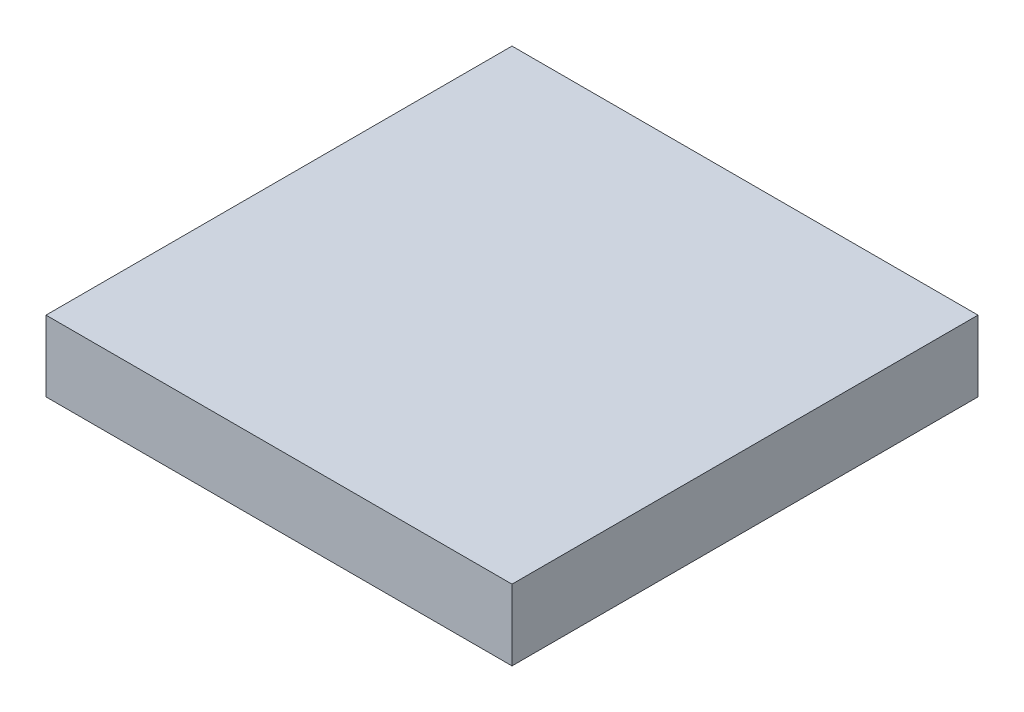
ISO-10303-21;
HEADER;
FILE_DESCRIPTION(('STEP AP214'),'2;1');
FILE_NAME('part.step','',(''),(''),'','','');
FILE_SCHEMA(('AUTOMOTIVE_DESIGN { 1 0 10303 214 1 1 1 1 }'));
ENDSEC;
DATA;
#1=APPLICATION_CONTEXT('core data for automotive mechanical design processes');
#2=APPLICATION_PROTOCOL_DEFINITION('international standard','automotive_design',2000,#1);
#3=PRODUCT_CONTEXT('',#1,'mechanical');
#4=PRODUCT('Part','Part','',(#3));
#5=PRODUCT_RELATED_PRODUCT_CATEGORY('part','',(#4));
#6=PRODUCT_DEFINITION_FORMATION('','',#4);
#7=PRODUCT_DEFINITION_CONTEXT('part definition',#1,'design');
#8=PRODUCT_DEFINITION('design','',#6,#7);
#9=PRODUCT_DEFINITION_SHAPE('','',#8);
#10=(LENGTH_UNIT() NAMED_UNIT(*) SI_UNIT(.MILLI.,.METRE.));
#11=(NAMED_UNIT(*) PLANE_ANGLE_UNIT() SI_UNIT($,.RADIAN.));
#12=(NAMED_UNIT(*) SI_UNIT($,.STERADIAN.) SOLID_ANGLE_UNIT());
#13=UNCERTAINTY_MEASURE_WITH_UNIT(LENGTH_MEASURE(1.E-05),#10,'distance_accuracy_value','');
#14=(GEOMETRIC_REPRESENTATION_CONTEXT(3) GLOBAL_UNCERTAINTY_ASSIGNED_CONTEXT((#13)) GLOBAL_UNIT_ASSIGNED_CONTEXT((#10,
#11,#12)) REPRESENTATION_CONTEXT('',''));
#15=CARTESIAN_POINT('',(0.,0.,0.));
#16=DIRECTION('',(0.,0.,1.));
#17=DIRECTION('',(1.,0.,0.));
#18=AXIS2_PLACEMENT_3D('',#15,#16,#17);
#19=CARTESIAN_POINT('',(4.99999999999997,1.52,-5.));
#20=DIRECTION('',(-1.,0.,0.));
#21=DIRECTION('',(0.,0.,1.));
#22=AXIS2_PLACEMENT_3D('',#19,#20,#21);
#23=PLANE('',#22);
#24=DIRECTION('',(0.,0.,-1.));
#25=VECTOR('',#24,1.);
#26=CARTESIAN_POINT('',(4.99999999999997,0.,-5.));
#27=LINE('',#26,#25);
#28=CARTESIAN_POINT('',(4.99999999999998,0.,5.));
#29=VERTEX_POINT('',#28);
#30=CARTESIAN_POINT('',(4.99999999999997,0.,-5.));
#31=VERTEX_POINT('',#30);
#32=EDGE_CURVE('E97',#29,#31,#27,.T.);
#33=ORIENTED_EDGE('',*,*,#32,.T.);
#34=DIRECTION('',(0.,-1.,0.));
#35=VECTOR('',#34,1.);
#36=CARTESIAN_POINT('',(4.99999999999997,1.52,-5.));
#37=LINE('',#36,#35);
#38=CARTESIAN_POINT('',(4.99999999999997,1.52,-5.));
#39=VERTEX_POINT('',#38);
#40=EDGE_CURVE('E11',#39,#31,#37,.T.);
#41=ORIENTED_EDGE('',*,*,#40,.F.);
#42=DIRECTION('',(0.,0.,-1.));
#43=VECTOR('',#42,1.);
#44=CARTESIAN_POINT('',(4.99999999999997,1.52,-5.));
#45=LINE('',#44,#43);
#46=CARTESIAN_POINT('',(4.99999999999998,1.52,5.));
#47=VERTEX_POINT('',#46);
#48=EDGE_CURVE('E85',#47,#39,#45,.T.);
#49=ORIENTED_EDGE('',*,*,#48,.F.);
#50=DIRECTION('',(0.,-1.,0.));
#51=VECTOR('',#50,1.);
#52=CARTESIAN_POINT('',(4.99999999999998,1.52,5.));
#53=LINE('',#52,#51);
#54=EDGE_CURVE('E93',#47,#29,#53,.T.);
#55=ORIENTED_EDGE('',*,*,#54,.T.);
#56=EDGE_LOOP('',(#33,#41,#49,#55));
#57=FACE_BOUND('',#56,.T.);
#58=ADVANCED_FACE('F34',(#57),#23,.F.);
#59=CARTESIAN_POINT('',(-5.00000000000001,1.52,-5.));
#60=DIRECTION('',(0.,0.,1.));
#61=DIRECTION('',(1.,0.,0.));
#62=AXIS2_PLACEMENT_3D('',#59,#60,#61);
#63=PLANE('',#62);
#64=DIRECTION('',(-1.,0.,0.));
#65=VECTOR('',#64,1.);
#66=CARTESIAN_POINT('',(-5.00000000000001,0.,-5.));
#67=LINE('',#66,#65);
#68=CARTESIAN_POINT('',(-5.00000000000001,0.,-5.));
#69=VERTEX_POINT('',#68);
#70=EDGE_CURVE('E89',#31,#69,#67,.T.);
#71=ORIENTED_EDGE('',*,*,#70,.T.);
#72=DIRECTION('',(0.,-1.,0.));
#73=VECTOR('',#72,1.);
#74=CARTESIAN_POINT('',(-5.00000000000001,1.52,-5.));
#75=LINE('',#74,#73);
#76=CARTESIAN_POINT('',(-5.00000000000001,1.52,-5.));
#77=VERTEX_POINT('',#76);
#78=EDGE_CURVE('E42',#77,#69,#75,.T.);
#79=ORIENTED_EDGE('',*,*,#78,.F.);
#80=DIRECTION('',(-1.,0.,0.));
#81=VECTOR('',#80,1.);
#82=CARTESIAN_POINT('',(-5.00000000000001,1.52,-5.));
#83=LINE('',#82,#81);
#84=EDGE_CURVE('E80',#39,#77,#83,.T.);
#85=ORIENTED_EDGE('',*,*,#84,.F.);
#86=ORIENTED_EDGE('',*,*,#40,.T.);
#87=EDGE_LOOP('',(#71,#79,#85,#86));
#88=FACE_BOUND('',#87,.T.);
#89=ADVANCED_FACE('F88',(#88),#63,.F.);
#90=CARTESIAN_POINT('',(-5.00000000000001,1.52,-5.));
#91=DIRECTION('',(1.,0.,0.));
#92=DIRECTION('',(0.,0.,-1.));
#93=AXIS2_PLACEMENT_3D('',#90,#91,#92);
#94=PLANE('',#93);
#95=DIRECTION('',(0.,0.,1.));
#96=VECTOR('',#95,1.);
#97=CARTESIAN_POINT('',(-5.00000000000001,0.,-5.));
#98=LINE('',#97,#96);
#99=CARTESIAN_POINT('',(-5.00000000000001,0.,5.));
#100=VERTEX_POINT('',#99);
#101=EDGE_CURVE('E67',#69,#100,#98,.T.);
#102=ORIENTED_EDGE('',*,*,#101,.T.);
#103=DIRECTION('',(0.,-1.,0.));
#104=VECTOR('',#103,1.);
#105=CARTESIAN_POINT('',(-5.00000000000001,1.52,5.));
#106=LINE('',#105,#104);
#107=CARTESIAN_POINT('',(-5.00000000000001,1.52,5.));
#108=VERTEX_POINT('',#107);
#109=EDGE_CURVE('E90',#108,#100,#106,.T.);
#110=ORIENTED_EDGE('',*,*,#109,.F.);
#111=DIRECTION('',(0.,0.,1.));
#112=VECTOR('',#111,1.);
#113=CARTESIAN_POINT('',(-5.00000000000001,1.52,-5.));
#114=LINE('',#113,#112);
#115=EDGE_CURVE('E83',#77,#108,#114,.T.);
#116=ORIENTED_EDGE('',*,*,#115,.F.);
#117=ORIENTED_EDGE('',*,*,#78,.T.);
#118=EDGE_LOOP('',(#102,#110,#116,#117));
#119=FACE_BOUND('',#118,.T.);
#120=ADVANCED_FACE('F91',(#119),#94,.F.);
#121=CARTESIAN_POINT('',(-5.00000000000001,1.52,5.));
#122=DIRECTION('',(0.,0.,-1.));
#123=DIRECTION('',(-1.,0.,0.));
#124=AXIS2_PLACEMENT_3D('',#121,#122,#123);
#125=PLANE('',#124);
#126=DIRECTION('',(1.,0.,0.));
#127=VECTOR('',#126,1.);
#128=CARTESIAN_POINT('',(-5.00000000000001,0.,5.));
#129=LINE('',#128,#127);
#130=EDGE_CURVE('E73',#100,#29,#129,.T.);
#131=ORIENTED_EDGE('',*,*,#130,.T.);
#132=ORIENTED_EDGE('',*,*,#54,.F.);
#133=DIRECTION('',(1.,0.,0.));
#134=VECTOR('',#133,1.);
#135=CARTESIAN_POINT('',(-5.00000000000001,1.52,5.));
#136=LINE('',#135,#134);
#137=EDGE_CURVE('E50',#108,#47,#136,.T.);
#138=ORIENTED_EDGE('',*,*,#137,.F.);
#139=ORIENTED_EDGE('',*,*,#109,.T.);
#140=EDGE_LOOP('',(#131,#132,#138,#139));
#141=FACE_BOUND('',#140,.T.);
#142=ADVANCED_FACE('F104',(#141),#125,.F.);
#143=CARTESIAN_POINT('',(0.,1.52,0.));
#144=DIRECTION('',(0.,1.,0.));
#145=DIRECTION('',(0.,0.,1.));
#146=AXIS2_PLACEMENT_3D('',#143,#144,#145);
#147=PLANE('',#146);
#148=ORIENTED_EDGE('',*,*,#48,.T.);
#149=ORIENTED_EDGE('',*,*,#84,.T.);
#150=ORIENTED_EDGE('',*,*,#115,.T.);
#151=ORIENTED_EDGE('',*,*,#137,.T.);
#152=EDGE_LOOP('',(#148,#149,#150,#151));
#153=FACE_BOUND('',#152,.T.);
#154=ADVANCED_FACE('F81',(#153),#147,.T.);
#155=CARTESIAN_POINT('',(0.,0.,0.));
#156=DIRECTION('',(0.,1.,0.));
#157=DIRECTION('',(0.,0.,1.));
#158=AXIS2_PLACEMENT_3D('',#155,#156,#157);
#159=PLANE('',#158);
#160=ORIENTED_EDGE('',*,*,#32,.F.);
#161=ORIENTED_EDGE('',*,*,#130,.F.);
#162=ORIENTED_EDGE('',*,*,#101,.F.);
#163=ORIENTED_EDGE('',*,*,#70,.F.);
#164=EDGE_LOOP('',(#160,#161,#162,#163));
#165=FACE_BOUND('',#164,.T.);
#166=ADVANCED_FACE('F107',(#165),#159,.F.);
#167=CLOSED_SHELL('',(#58,#89,#120,#142,#154,#166));
#168=MANIFOLD_SOLID_BREP('B2',#167);
#169=ADVANCED_BREP_SHAPE_REPRESENTATION('',(#18,#168),#14);
#170=SHAPE_DEFINITION_REPRESENTATION(#9,#169);
ENDSEC;
END-ISO-10303-21;
